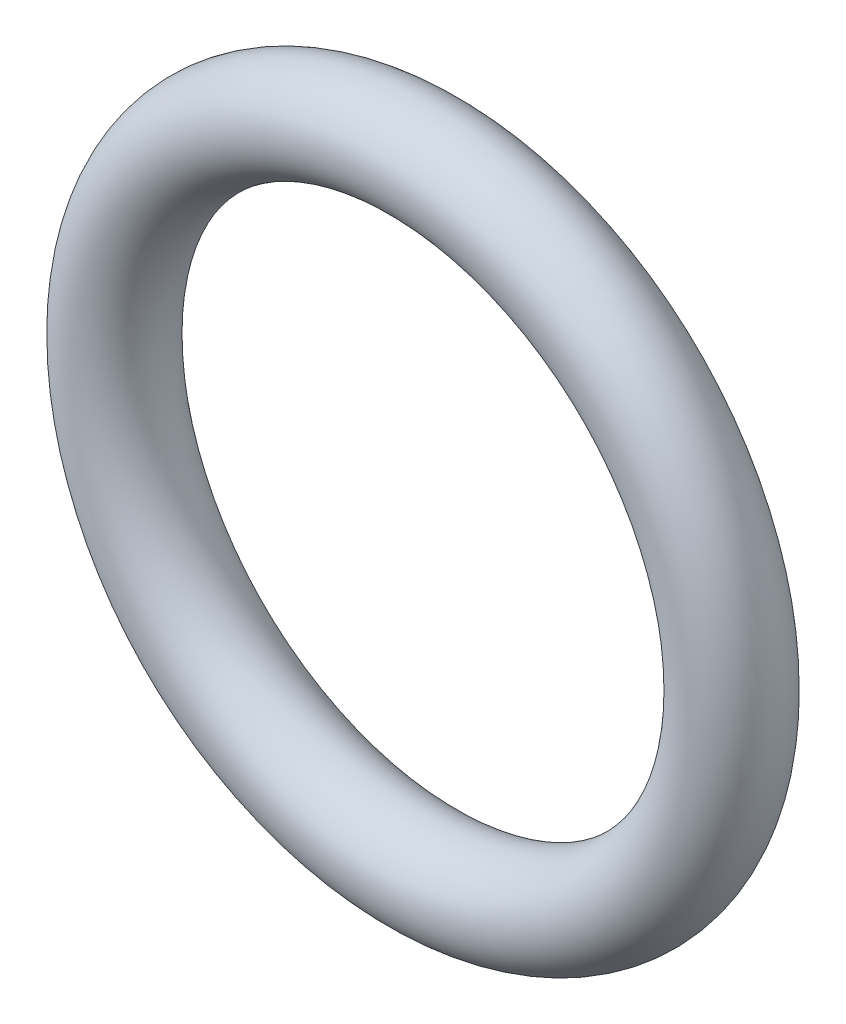
ISO-10303-21;
HEADER;
FILE_DESCRIPTION(('STEP AP214'),'2;1');
FILE_NAME('part.step','',(''),(''),'','','');
FILE_SCHEMA(('AUTOMOTIVE_DESIGN { 1 0 10303 214 1 1 1 1 }'));
ENDSEC;
DATA;
#1=APPLICATION_CONTEXT('core data for automotive mechanical design processes');
#2=APPLICATION_PROTOCOL_DEFINITION('international standard','automotive_design',2000,#1);
#3=PRODUCT_CONTEXT('',#1,'mechanical');
#4=PRODUCT('Part','Part','',(#3));
#5=PRODUCT_RELATED_PRODUCT_CATEGORY('part','',(#4));
#6=PRODUCT_DEFINITION_FORMATION('','',#4);
#7=PRODUCT_DEFINITION_CONTEXT('part definition',#1,'design');
#8=PRODUCT_DEFINITION('design','',#6,#7);
#9=PRODUCT_DEFINITION_SHAPE('','',#8);
#10=(LENGTH_UNIT() NAMED_UNIT(*) SI_UNIT(.MILLI.,.METRE.));
#11=(NAMED_UNIT(*) PLANE_ANGLE_UNIT() SI_UNIT($,.RADIAN.));
#12=(NAMED_UNIT(*) SI_UNIT($,.STERADIAN.) SOLID_ANGLE_UNIT());
#13=UNCERTAINTY_MEASURE_WITH_UNIT(LENGTH_MEASURE(1.E-05),#10,'distance_accuracy_value','');
#14=(GEOMETRIC_REPRESENTATION_CONTEXT(3) GLOBAL_UNCERTAINTY_ASSIGNED_CONTEXT((#13)) GLOBAL_UNIT_ASSIGNED_CONTEXT((#10,
#11,#12)) REPRESENTATION_CONTEXT('',''));
#15=CARTESIAN_POINT('',(0.,0.,0.));
#16=DIRECTION('',(0.,0.,1.));
#17=DIRECTION('',(1.,0.,0.));
#18=AXIS2_PLACEMENT_3D('',#15,#16,#17);
#19=CARTESIAN_POINT('',(0.,0.,0.));
#20=DIRECTION('',(0.,0.,-1.));
#21=DIRECTION('',(1.,0.,0.));
#22=AXIS2_PLACEMENT_3D('',#19,#20,#21);
#23=TOROIDAL_SURFACE('',#22,5.74,0.89);
#24=ADVANCED_FACE('F14',(),#23,.T.);
#25=CLOSED_SHELL('',(#24));
#26=MANIFOLD_SOLID_BREP('B1',#25);
#27=ADVANCED_BREP_SHAPE_REPRESENTATION('',(#18,#26),#14);
#28=SHAPE_DEFINITION_REPRESENTATION(#9,#27);
ENDSEC;
END-ISO-10303-21;
